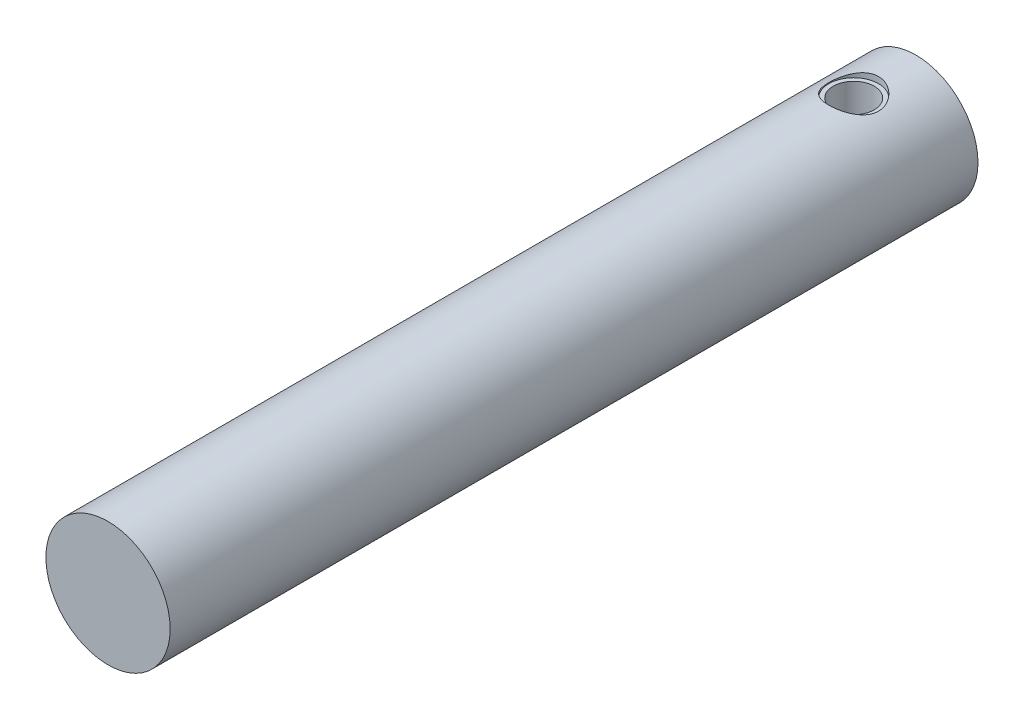
ISO-10303-21;
HEADER;
FILE_DESCRIPTION(('STEP AP214'),'2;1');
FILE_NAME('part.step','',(''),(''),'','','');
FILE_SCHEMA(('AUTOMOTIVE_DESIGN { 1 0 10303 214 1 1 1 1 }'));
ENDSEC;
DATA;
#1=APPLICATION_CONTEXT('core data for automotive mechanical design processes');
#2=APPLICATION_PROTOCOL_DEFINITION('international standard','automotive_design',2000,#1);
#3=PRODUCT_CONTEXT('',#1,'mechanical');
#4=PRODUCT('Part','Part','',(#3));
#5=PRODUCT_RELATED_PRODUCT_CATEGORY('part','',(#4));
#6=PRODUCT_DEFINITION_FORMATION('','',#4);
#7=PRODUCT_DEFINITION_CONTEXT('part definition',#1,'design');
#8=PRODUCT_DEFINITION('design','',#6,#7);
#9=PRODUCT_DEFINITION_SHAPE('','',#8);
#10=(LENGTH_UNIT() NAMED_UNIT(*) SI_UNIT(.MILLI.,.METRE.));
#11=(NAMED_UNIT(*) PLANE_ANGLE_UNIT() SI_UNIT($,.RADIAN.));
#12=(NAMED_UNIT(*) SI_UNIT($,.STERADIAN.) SOLID_ANGLE_UNIT());
#13=UNCERTAINTY_MEASURE_WITH_UNIT(LENGTH_MEASURE(1.E-05),#10,'distance_accuracy_value','');
#14=(GEOMETRIC_REPRESENTATION_CONTEXT(3) GLOBAL_UNCERTAINTY_ASSIGNED_CONTEXT((#13)) GLOBAL_UNIT_ASSIGNED_CONTEXT((#10,
#11,#12)) REPRESENTATION_CONTEXT('',''));
#15=CARTESIAN_POINT('',(0.,0.,0.));
#16=DIRECTION('',(0.,0.,1.));
#17=DIRECTION('',(1.,0.,0.));
#18=AXIS2_PLACEMENT_3D('',#15,#16,#17);
#19=CARTESIAN_POINT('',(0.,0.,-65.));
#20=DIRECTION('',(0.,0.,-1.));
#21=DIRECTION('',(-1.,0.,0.));
#22=AXIS2_PLACEMENT_3D('',#19,#20,#21);
#23=PLANE('',#22);
#24=CARTESIAN_POINT('',(0.,0.,-65.));
#25=DIRECTION('',(0.,0.,1.));
#26=DIRECTION('',(1.,0.,0.));
#27=AXIS2_PLACEMENT_3D('',#24,#25,#26);
#28=CIRCLE('',#27,5.);
#29=CARTESIAN_POINT('',(5.,0.,-65.));
#30=VERTEX_POINT('',#29);
#31=EDGE_CURVE('E55',#30,#30,#28,.T.);
#32=ORIENTED_EDGE('',*,*,#31,.F.);
#33=EDGE_LOOP('',(#32));
#34=FACE_BOUND('',#33,.T.);
#35=ADVANCED_FACE('F44',(#34),#23,.T.);
#36=CARTESIAN_POINT('',(0.,0.,16.7466518098952));
#37=DIRECTION('',(0.,0.,1.));
#38=DIRECTION('',(1.,0.,0.));
#39=AXIS2_PLACEMENT_3D('',#36,#37,#38);
#40=CYLINDRICAL_SURFACE('',#39,5.);
#41=CARTESIAN_POINT('',(0.,5.,-58.));
#42=CARTESIAN_POINT('',(0.107493005442891,4.99999271227085,-58.0000098518237));
#43=CARTESIAN_POINT('',(0.215172564090673,4.99649294306933,-58.0087177520884));
#44=CARTESIAN_POINT('',(0.427496480417896,4.98283453100642,-58.0432477035212));
#45=CARTESIAN_POINT('',(0.532131777561248,4.97265778698877,-58.0691162790861));
#46=CARTESIAN_POINT('',(0.734953922727403,4.94674209213119,-58.1368760780588));
#47=CARTESIAN_POINT('',(0.833160661616959,4.93102136364072,-58.1787148462167));
#48=CARTESIAN_POINT('',(1.02107197032837,4.89556610796078,-58.2770191733265));
#49=CARTESIAN_POINT('',(1.11077947675099,4.87583297458057,-58.3334796549189));
#50=CARTESIAN_POINT('',(1.28350100757039,4.83330886170419,-58.4622354985609));
#51=CARTESIAN_POINT('',(1.36606227255021,4.81042296929191,-58.5351066562403));
#52=CARTESIAN_POINT('',(1.51817500478472,4.76460576906195,-58.6934000034768));
#53=CARTESIAN_POINT('',(1.58772010713353,4.74167444453792,-58.7788282972117));
#54=CARTESIAN_POINT('',(1.71487456729288,4.69722791797136,-58.9644280702423));
#55=CARTESIAN_POINT('',(1.77181498119547,4.67582115964951,-59.0650864860232));
#56=CARTESIAN_POINT('',(1.86775471903715,4.63833647186793,-59.27553639842));
#57=CARTESIAN_POINT('',(1.90676256428583,4.62225601244176,-59.3853235278484));
#58=CARTESIAN_POINT('',(1.96389882339587,4.59826357660819,-59.6057123335921));
#59=CARTESIAN_POINT('',(1.98289396580565,4.59001420355605,-59.7160512355762));
#60=CARTESIAN_POINT('',(2.00217296164003,4.58164004049144,-59.9386349983073));
#61=CARTESIAN_POINT('',(2.00246601631322,4.58151125522768,-60.050878894625));
#62=CARTESIAN_POINT('',(1.98498936750454,4.58910500279994,-60.265756671458));
#63=CARTESIAN_POINT('',(1.96847531430514,4.5962817503845,-60.368515714409));
#64=CARTESIAN_POINT('',(1.91994688029782,4.61676187607836,-60.5696595560067));
#65=CARTESIAN_POINT('',(1.88792979480463,4.63006632321673,-60.6680435881103));
#66=CARTESIAN_POINT('',(1.80869473255107,4.6615948508853,-60.860017836196));
#67=CARTESIAN_POINT('',(1.76117986231532,4.67991379280788,-60.9534692390547));
#68=CARTESIAN_POINT('',(1.65250646073221,4.7193811638989,-61.1314158163616));
#69=CARTESIAN_POINT('',(1.59134280510084,4.74053065456849,-61.2159076094028));
#70=CARTESIAN_POINT('',(1.45155059945443,4.78526736742271,-61.380409728802));
#71=CARTESIAN_POINT('',(1.37193746297063,4.80891664976152,-61.459568729446));
#72=CARTESIAN_POINT('',(1.20031442743019,4.85459824958282,-61.603684478002));
#73=CARTESIAN_POINT('',(1.10830206533443,4.87663024445325,-61.6686383974103));
#74=CARTESIAN_POINT('',(0.912077652605841,4.91714681264548,-61.7836174474158));
#75=CARTESIAN_POINT('',(0.807660491346474,4.93555270095415,-61.833322281197));
#76=CARTESIAN_POINT('',(0.591023765482879,4.96614828328759,-61.9141678610781));
#77=CARTESIAN_POINT('',(0.478808196849671,4.97834113462382,-61.9453180375574));
#78=CARTESIAN_POINT('',(0.256895887607818,4.99456139506911,-61.9864482954197));
#79=CARTESIAN_POINT('',(0.147443293985533,4.99902945833514,-61.9975724542536));
#80=CARTESIAN_POINT('',(-0.0718453098078182,5.00068478510631,-62.0017131005286));
#81=CARTESIAN_POINT('',(-0.181681213223924,4.99787393582292,-61.9947342815475));
#82=CARTESIAN_POINT('',(-0.393432739121987,4.98557567063753,-61.963708247448));
#83=CARTESIAN_POINT('',(-0.495482491775473,4.97639391345523,-61.940442019649));
#84=CARTESIAN_POINT('',(-0.694135428060779,4.952594414055,-61.8785642916902));
#85=CARTESIAN_POINT('',(-0.790737910224845,4.93797597356531,-61.8399508203313));
#86=CARTESIAN_POINT('',(-0.979078785816703,4.90416594770812,-61.7472150603201));
#87=CARTESIAN_POINT('',(-1.0705780227554,4.88484815979804,-61.6926545279569));
#88=CARTESIAN_POINT('',(-1.24344359124655,4.84373364745525,-61.5700596760944));
#89=CARTESIAN_POINT('',(-1.32480584076112,4.82193593110271,-61.5020199570774));
#90=CARTESIAN_POINT('',(-1.48072304302882,4.77645117638112,-61.3491299870504));
#91=CARTESIAN_POINT('',(-1.55447393380607,4.75273441425052,-61.2634664584938));
#92=CARTESIAN_POINT('',(-1.68675119741371,4.70741672917132,-61.0805599169906));
#93=CARTESIAN_POINT('',(-1.74527506133751,4.68581615526511,-60.98331499966));
#94=CARTESIAN_POINT('',(-1.84580750193163,4.64714299907709,-60.7785383054059));
#95=CARTESIAN_POINT('',(-1.88765059453445,4.63011630884788,-60.6709160007877));
#96=CARTESIAN_POINT('',(-1.9522962197053,4.60323673477932,-60.4492663482848));
#97=CARTESIAN_POINT('',(-1.97511280526931,4.59337855695998,-60.3352437941876));
#98=CARTESIAN_POINT('',(-1.9997156172784,4.58271759299926,-60.1128720982255));
#99=CARTESIAN_POINT('',(-2.00289708230287,4.58131421008171,-60.0047051604067));
#100=CARTESIAN_POINT('',(-1.99180315927752,4.58614836033098,-59.7894551422867));
#101=CARTESIAN_POINT('',(-1.97752998791378,4.59238492324794,-59.6823719260974));
#102=CARTESIAN_POINT('',(-1.93307136615365,4.61126649079021,-59.476667810145));
#103=CARTESIAN_POINT('',(-1.90353749357098,4.62364831827449,-59.377879725567));
#104=CARTESIAN_POINT('',(-1.83000544849101,4.65324001232697,-59.1866213703865));
#105=CARTESIAN_POINT('',(-1.78600328139381,4.67045121206007,-59.0941528531002));
#106=CARTESIAN_POINT('',(-1.68187276275973,4.70898609604492,-58.9123903807292));
#107=CARTESIAN_POINT('',(-1.62096533515949,4.73048882313242,-58.8235813298695));
#108=CARTESIAN_POINT('',(-1.4858921192715,4.77463804372237,-58.6570066827962));
#109=CARTESIAN_POINT('',(-1.41172233481812,4.79728488048406,-58.5792444278717));
#110=CARTESIAN_POINT('',(-1.24650550627246,4.84293567087394,-58.4317971467364));
#111=CARTESIAN_POINT('',(-1.15467600114614,4.86586757962185,-58.3629626931019));
#112=CARTESIAN_POINT('',(-0.959900320285779,4.90800406713717,-58.2416629573784));
#113=CARTESIAN_POINT('',(-0.856949004547238,4.92720691092906,-58.1892052878475));
#114=CARTESIAN_POINT('',(-0.644738062495205,4.95939714815861,-58.1033777848097));
#115=CARTESIAN_POINT('',(-0.535631618219697,4.97249363055028,-58.0696706764397));
#116=CARTESIAN_POINT('',(-0.31287654628122,4.99144306209366,-58.0213608790457));
#117=CARTESIAN_POINT('',(-0.199243525858912,4.99731899495638,-58.0066975632561));
#118=CARTESIAN_POINT('',(-0.0569122978909289,4.99975899504137,-58.0006046190217));
#119=CARTESIAN_POINT('',(-0.028462688740758,5.00000192969176,-57.9999973913708));
#120=CARTESIAN_POINT('',(0.,5.,-58.));
#121=B_SPLINE_CURVE_WITH_KNOTS('',3,(#41,#42,#43,#44,#45,#46,#47,#48,#49,#50,#51,#52,#53,#54,
#55,#56,#57,#58,#59,#60,#61,#62,#63,#64,#65,#66,#67,#68,#69,#70,#71,#72,#73,#74,#75,#76,#77,#78,
#79,#80,#81,#82,#83,#84,#85,#86,#87,#88,#89,#90,#91,#92,#93,#94,#95,#96,#97,#98,#99,#100,#101,
#102,#103,#104,#105,#106,#107,#108,#109,#110,#111,#112,#113,#114,#115,#116,#117,#118,#119,#120),
.UNSPECIFIED.,.T.,.F.,(4,2,2,2,2,2,2,2,2,2,2,2,2,2,2,2,2,2,2,2,2,2,2,2,2,2,2,2,2,2,2,2,2,2,2,2,
2,2,2,4),(0.,0.322402987893071,0.645683636007934,0.96791145747158,1.29002753567984,
1.62597381700397,1.96208394934412,2.31315258819217,2.66405423118268,2.99904105308828,
3.33386306340488,3.64538328401372,3.95695787256048,4.27489126298816,4.59294421938184,
4.93558349186558,5.27829092839733,5.62776913162807,5.97706956113791,6.30569184528008,
6.63422893570082,6.94800455564365,7.26182048993796,7.58523513398263,7.90877959498969,
8.25368474624414,8.59864669043748,8.94695045140828,9.29499672645933,9.61799673392748,
9.94095572563046,10.2511431854877,10.5614163580516,10.8894546805669,11.2175920134839,
11.5670042353384,11.9165786364053,12.2596430101332,12.6016125240434,12.686980458968),.UNSPECIFIED.);
#122=CARTESIAN_POINT('',(0.,5.,-58.));
#123=VERTEX_POINT('',#122);
#124=EDGE_CURVE('E11',#123,#123,#121,.T.);
#125=ORIENTED_EDGE('',*,*,#124,.F.);
#126=EDGE_LOOP('',(#125));
#127=FACE_BOUND('',#126,.T.);
#128=ORIENTED_EDGE('',*,*,#31,.T.);
#129=EDGE_LOOP('',(#128));
#130=FACE_BOUND('',#129,.T.);
#131=CARTESIAN_POINT('',(0.,0.,0.));
#132=DIRECTION('',(0.,0.,1.));
#133=DIRECTION('',(1.,0.,0.));
#134=AXIS2_PLACEMENT_3D('',#131,#132,#133);
#135=CIRCLE('',#134,5.);
#136=CARTESIAN_POINT('',(5.,0.,0.));
#137=VERTEX_POINT('',#136);
#138=EDGE_CURVE('E76',#137,#137,#135,.T.);
#139=ORIENTED_EDGE('',*,*,#138,.F.);
#140=EDGE_LOOP('',(#139));
#141=FACE_BOUND('',#140,.T.);
#142=ADVANCED_FACE('F88',(#127,#130,#141),#40,.T.);
#143=CARTESIAN_POINT('',(0.,0.,0.));
#144=DIRECTION('',(0.,0.,1.));
#145=DIRECTION('',(1.,0.,0.));
#146=AXIS2_PLACEMENT_3D('',#143,#144,#145);
#147=PLANE('',#146);
#148=ORIENTED_EDGE('',*,*,#138,.T.);
#149=EDGE_LOOP('',(#148));
#150=FACE_BOUND('',#149,.T.);
#151=ADVANCED_FACE('F95',(#150),#147,.T.);
#152=CARTESIAN_POINT('',(0.,4.5,-60.));
#153=DIRECTION('',(0.,1.,0.));
#154=DIRECTION('',(0.,0.,1.));
#155=AXIS2_PLACEMENT_3D('',#152,#153,#154);
#156=CYLINDRICAL_SURFACE('',#155,2.);
#157=ORIENTED_EDGE('',*,*,#124,.T.);
#158=EDGE_LOOP('',(#157));
#159=FACE_BOUND('',#158,.T.);
#160=CARTESIAN_POINT('',(0.,4.5,-60.));
#161=DIRECTION('',(0.,1.,0.));
#162=DIRECTION('',(0.,0.,1.));
#163=AXIS2_PLACEMENT_3D('',#160,#161,#162);
#164=CIRCLE('',#163,2.);
#165=CARTESIAN_POINT('',(0.,4.5,-58.));
#166=VERTEX_POINT('',#165);
#167=EDGE_CURVE('E69',#166,#166,#164,.T.);
#168=ORIENTED_EDGE('',*,*,#167,.F.);
#169=EDGE_LOOP('',(#168));
#170=FACE_BOUND('',#169,.T.);
#171=ADVANCED_FACE('F100',(#159,#170),#156,.F.);
#172=CARTESIAN_POINT('',(0.,4.5,-60.));
#173=DIRECTION('',(0.,1.,0.));
#174=DIRECTION('',(0.,0.,1.));
#175=AXIS2_PLACEMENT_3D('',#172,#173,#174);
#176=PLANE('',#175);
#177=CARTESIAN_POINT('',(0.,4.5,-60.));
#178=DIRECTION('',(0.,1.,0.));
#179=DIRECTION('',(0.,0.,1.));
#180=AXIS2_PLACEMENT_3D('',#177,#178,#179);
#181=CIRCLE('',#180,1.64999999999999);
#182=CARTESIAN_POINT('',(0.,4.5,-58.35));
#183=VERTEX_POINT('',#182);
#184=EDGE_CURVE('E70',#183,#183,#181,.T.);
#185=ORIENTED_EDGE('',*,*,#184,.F.);
#186=EDGE_LOOP('',(#185));
#187=FACE_BOUND('',#186,.T.);
#188=ORIENTED_EDGE('',*,*,#167,.T.);
#189=EDGE_LOOP('',(#188));
#190=FACE_BOUND('',#189,.T.);
#191=ADVANCED_FACE('F62',(#187,#190),#176,.T.);
#192=CARTESIAN_POINT('',(0.,-0.5,-60.));
#193=DIRECTION('',(0.,1.,0.));
#194=DIRECTION('',(0.,0.,1.));
#195=AXIS2_PLACEMENT_3D('',#192,#193,#194);
#196=CONICAL_SURFACE('',#195,1.65,1.02974425867665);
#197=CARTESIAN_POINT('',(0.,-1.49142002139547,-60.));
#198=VERTEX_POINT('',#197);
#199=VERTEX_LOOP('',#198);
#200=FACE_BOUND('',#199,.T.);
#201=CARTESIAN_POINT('',(0.,-0.5,-60.));
#202=DIRECTION('',(0.,1.,0.));
#203=DIRECTION('',(0.,0.,1.));
#204=AXIS2_PLACEMENT_3D('',#201,#202,#203);
#205=CIRCLE('',#204,1.65);
#206=CARTESIAN_POINT('',(0.,-0.5,-58.35));
#207=VERTEX_POINT('',#206);
#208=EDGE_CURVE('E66',#207,#207,#205,.T.);
#209=ORIENTED_EDGE('',*,*,#208,.T.);
#210=EDGE_LOOP('',(#209));
#211=FACE_BOUND('',#210,.T.);
#212=ADVANCED_FACE('F58',(#200,#211),#196,.F.);
#213=CARTESIAN_POINT('',(0.,4.5,-60.));
#214=DIRECTION('',(0.,1.,0.));
#215=DIRECTION('',(0.,0.,1.));
#216=AXIS2_PLACEMENT_3D('',#213,#214,#215);
#217=CYLINDRICAL_SURFACE('',#216,1.64999999999999);
#218=ORIENTED_EDGE('',*,*,#208,.F.);
#219=EDGE_LOOP('',(#218));
#220=FACE_BOUND('',#219,.T.);
#221=ORIENTED_EDGE('',*,*,#184,.T.);
#222=EDGE_LOOP('',(#221));
#223=FACE_BOUND('',#222,.T.);
#224=ADVANCED_FACE('F61',(#220,#223),#217,.F.);
#225=CLOSED_SHELL('',(#35,#142,#151,#171,#191,#212,#224));
#226=MANIFOLD_SOLID_BREP('B2',#225);
#227=ADVANCED_BREP_SHAPE_REPRESENTATION('',(#18,#226),#14);
#228=SHAPE_DEFINITION_REPRESENTATION(#9,#227);
ENDSEC;
END-ISO-10303-21;
